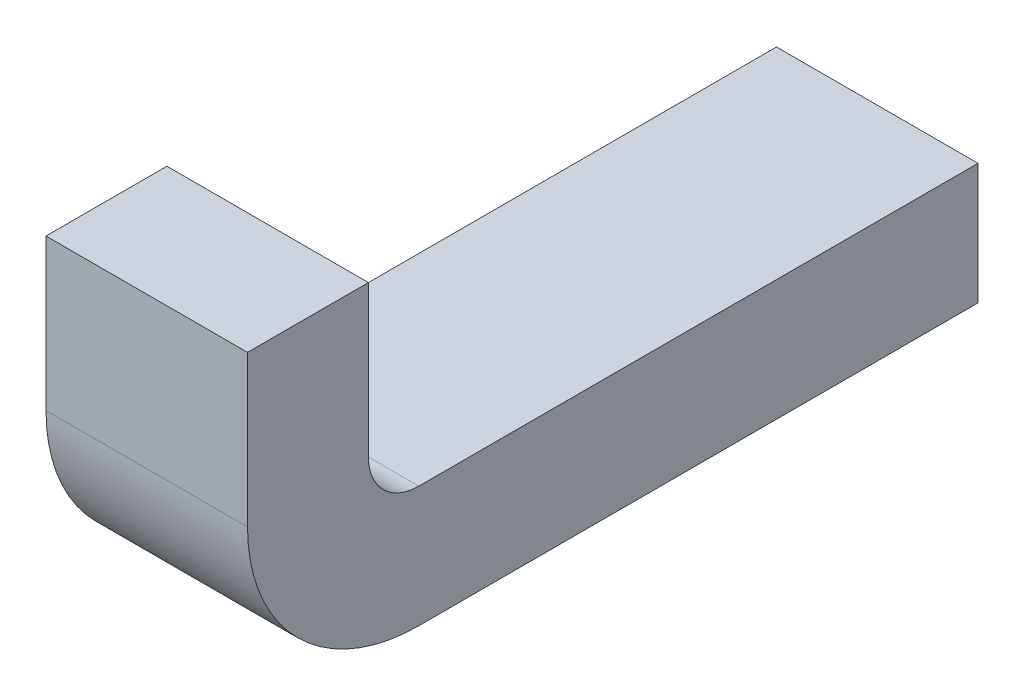
ISO-10303-21;
HEADER;
FILE_DESCRIPTION(('STEP AP214'),'2;1');
FILE_NAME('part.step','',(''),(''),'','','');
FILE_SCHEMA(('AUTOMOTIVE_DESIGN { 1 0 10303 214 1 1 1 1 }'));
ENDSEC;
DATA;
#1=APPLICATION_CONTEXT('core data for automotive mechanical design processes');
#2=APPLICATION_PROTOCOL_DEFINITION('international standard','automotive_design',2000,#1);
#3=PRODUCT_CONTEXT('',#1,'mechanical');
#4=PRODUCT('Part','Part','',(#3));
#5=PRODUCT_RELATED_PRODUCT_CATEGORY('part','',(#4));
#6=PRODUCT_DEFINITION_FORMATION('','',#4);
#7=PRODUCT_DEFINITION_CONTEXT('part definition',#1,'design');
#8=PRODUCT_DEFINITION('design','',#6,#7);
#9=PRODUCT_DEFINITION_SHAPE('','',#8);
#10=(LENGTH_UNIT() NAMED_UNIT(*) SI_UNIT(.MILLI.,.METRE.));
#11=(NAMED_UNIT(*) PLANE_ANGLE_UNIT() SI_UNIT($,.RADIAN.));
#12=(NAMED_UNIT(*) SI_UNIT($,.STERADIAN.) SOLID_ANGLE_UNIT());
#13=UNCERTAINTY_MEASURE_WITH_UNIT(LENGTH_MEASURE(1.E-05),#10,'distance_accuracy_value','');
#14=(GEOMETRIC_REPRESENTATION_CONTEXT(3) GLOBAL_UNCERTAINTY_ASSIGNED_CONTEXT((#13)) GLOBAL_UNIT_ASSIGNED_CONTEXT((#10,
#11,#12)) REPRESENTATION_CONTEXT('',''));
#15=CARTESIAN_POINT('',(0.,0.,0.));
#16=DIRECTION('',(0.,0.,1.));
#17=DIRECTION('',(1.,0.,0.));
#18=AXIS2_PLACEMENT_3D('',#15,#16,#17);
#19=CARTESIAN_POINT('',(-0.35,0.,-3.300000000002));
#20=DIRECTION('',(0.,-1.,0.));
#21=DIRECTION('',(1.,0.,0.));
#22=AXIS2_PLACEMENT_3D('',#19,#20,#21);
#23=PLANE('',#22);
#24=DIRECTION('',(0.,0.,1.));
#25=VECTOR('',#24,1.);
#26=CARTESIAN_POINT('',(-0.35,0.,-3.300000000002));
#27=LINE('',#26,#25);
#28=CARTESIAN_POINT('',(-0.35,0.,-3.300000000002));
#29=VERTEX_POINT('',#28);
#30=CARTESIAN_POINT('',(-0.35,0.,-3.854999999999));
#31=VERTEX_POINT('',#30);
#32=EDGE_CURVE('E121',#29,#31,#27,.F.);
#33=ORIENTED_EDGE('',*,*,#32,.T.);
#34=DIRECTION('',(-1.,0.,0.));
#35=VECTOR('',#34,1.);
#36=CARTESIAN_POINT('',(-0.35,0.,-3.854999999999));
#37=LINE('',#36,#35);
#38=CARTESIAN_POINT('',(-0.15,0.,-3.854999999999));
#39=VERTEX_POINT('',#38);
#40=EDGE_CURVE('E124',#39,#31,#37,.T.);
#41=ORIENTED_EDGE('',*,*,#40,.F.);
#42=DIRECTION('',(0.,0.,1.));
#43=VECTOR('',#42,1.);
#44=CARTESIAN_POINT('',(-0.15,0.,-3.300000000002));
#45=LINE('',#44,#43);
#46=CARTESIAN_POINT('',(-0.15,0.,-3.300000000002));
#47=VERTEX_POINT('',#46);
#48=EDGE_CURVE('E154',#47,#39,#45,.F.);
#49=ORIENTED_EDGE('',*,*,#48,.F.);
#50=DIRECTION('',(1.,0.,0.));
#51=VECTOR('',#50,1.);
#52=CARTESIAN_POINT('',(-0.35,0.,-3.300000000002));
#53=LINE('',#52,#51);
#54=EDGE_CURVE('E63',#29,#47,#53,.T.);
#55=ORIENTED_EDGE('',*,*,#54,.F.);
#56=EDGE_LOOP('',(#33,#41,#49,#55));
#57=FACE_BOUND('',#56,.T.);
#58=ADVANCED_FACE('F16',(#57),#23,.T.);
#59=CARTESIAN_POINT('',(-0.35,0.32,-3.250000000002));
#60=DIRECTION('',(0.,1.,1.246832498358E-13));
#61=DIRECTION('',(0.,-1.246832498358E-13,1.));
#62=AXIS2_PLACEMENT_3D('',#59,#60,#61);
#63=PLANE('',#62);
#64=DIRECTION('',(0.,0.,1.));
#65=VECTOR('',#64,1.);
#66=CARTESIAN_POINT('',(-0.35,0.32,-3.300000000002));
#67=LINE('',#66,#65);
#68=CARTESIAN_POINT('',(-0.35,0.32,-3.250000000002));
#69=VERTEX_POINT('',#68);
#70=CARTESIAN_POINT('',(-0.35,0.32,-3.130000000002));
#71=VERTEX_POINT('',#70);
#72=EDGE_CURVE('E100',#69,#71,#67,.T.);
#73=ORIENTED_EDGE('',*,*,#72,.T.);
#74=DIRECTION('',(1.,0.,0.));
#75=VECTOR('',#74,1.);
#76=CARTESIAN_POINT('',(-0.35,0.32,-3.130000000002));
#77=LINE('',#76,#75);
#78=CARTESIAN_POINT('',(-0.15,0.32,-3.130000000002));
#79=VERTEX_POINT('',#78);
#80=EDGE_CURVE('E162',#79,#71,#77,.F.);
#81=ORIENTED_EDGE('',*,*,#80,.F.);
#82=DIRECTION('',(0.,0.,1.));
#83=VECTOR('',#82,1.);
#84=CARTESIAN_POINT('',(-0.15,0.32,-3.300000000002));
#85=LINE('',#84,#83);
#86=CARTESIAN_POINT('',(-0.15,0.32,-3.250000000002));
#87=VERTEX_POINT('',#86);
#88=EDGE_CURVE('E150',#87,#79,#85,.T.);
#89=ORIENTED_EDGE('',*,*,#88,.F.);
#90=DIRECTION('',(-1.,0.,0.));
#91=VECTOR('',#90,1.);
#92=CARTESIAN_POINT('',(-0.35,0.32,-3.250000000002));
#93=LINE('',#92,#91);
#94=EDGE_CURVE('E72',#69,#87,#93,.F.);
#95=ORIENTED_EDGE('',*,*,#94,.F.);
#96=EDGE_LOOP('',(#73,#81,#89,#95));
#97=FACE_BOUND('',#96,.T.);
#98=ADVANCED_FACE('F182',(#97),#63,.T.);
#99=CARTESIAN_POINT('',(-0.35,0.32,-3.130000000002));
#100=DIRECTION('',(0.,0.,1.));
#101=DIRECTION('',(1.,0.,0.));
#102=AXIS2_PLACEMENT_3D('',#99,#100,#101);
#103=PLANE('',#102);
#104=DIRECTION('',(0.,1.,0.));
#105=VECTOR('',#104,1.);
#106=CARTESIAN_POINT('',(-0.35,0.17,-3.130000000002));
#107=LINE('',#106,#105);
#108=CARTESIAN_POINT('',(-0.35,0.17,-3.130000000002));
#109=VERTEX_POINT('',#108);
#110=EDGE_CURVE('E110',#71,#109,#107,.F.);
#111=ORIENTED_EDGE('',*,*,#110,.T.);
#112=DIRECTION('',(1.,0.,0.));
#113=VECTOR('',#112,1.);
#114=CARTESIAN_POINT('',(-0.35,0.17,-3.130000000002));
#115=LINE('',#114,#113);
#116=CARTESIAN_POINT('',(-0.15,0.17,-3.130000000002));
#117=VERTEX_POINT('',#116);
#118=EDGE_CURVE('E57',#117,#109,#115,.F.);
#119=ORIENTED_EDGE('',*,*,#118,.F.);
#120=DIRECTION('',(0.,1.,0.));
#121=VECTOR('',#120,1.);
#122=CARTESIAN_POINT('',(-0.15,0.17,-3.130000000002));
#123=LINE('',#122,#121);
#124=EDGE_CURVE('E141',#79,#117,#123,.F.);
#125=ORIENTED_EDGE('',*,*,#124,.F.);
#126=ORIENTED_EDGE('',*,*,#80,.T.);
#127=EDGE_LOOP('',(#111,#119,#125,#126));
#128=FACE_BOUND('',#127,.T.);
#129=ADVANCED_FACE('F183',(#128),#103,.T.);
#130=CARTESIAN_POINT('',(-0.35,0.17,-3.300000000002));
#131=DIRECTION('',(1.,0.,0.));
#132=DIRECTION('',(0.,1.,0.));
#133=AXIS2_PLACEMENT_3D('',#130,#131,#132);
#134=CYLINDRICAL_SURFACE('',#133,0.17);
#135=CARTESIAN_POINT('',(-0.35,0.17,-3.300000000002));
#136=DIRECTION('',(1.,0.,0.));
#137=DIRECTION('',(0.,1.,0.));
#138=AXIS2_PLACEMENT_3D('',#135,#136,#137);
#139=CIRCLE('',#138,0.17);
#140=EDGE_CURVE('E96',#109,#29,#139,.T.);
#141=ORIENTED_EDGE('',*,*,#140,.T.);
#142=ORIENTED_EDGE('',*,*,#54,.T.);
#143=CARTESIAN_POINT('',(-0.15,0.17,-3.300000000002));
#144=DIRECTION('',(1.,0.,0.));
#145=DIRECTION('',(0.,1.,0.));
#146=AXIS2_PLACEMENT_3D('',#143,#144,#145);
#147=CIRCLE('',#146,0.17);
#148=EDGE_CURVE('E19',#117,#47,#147,.T.);
#149=ORIENTED_EDGE('',*,*,#148,.F.);
#150=ORIENTED_EDGE('',*,*,#118,.T.);
#151=EDGE_LOOP('',(#141,#142,#149,#150));
#152=FACE_BOUND('',#151,.T.);
#153=ADVANCED_FACE('F185',(#152),#134,.T.);
#154=CARTESIAN_POINT('',(-0.35,0.17,-3.250000000002));
#155=DIRECTION('',(0.,0.,-1.));
#156=DIRECTION('',(-1.,0.,0.));
#157=AXIS2_PLACEMENT_3D('',#154,#155,#156);
#158=PLANE('',#157);
#159=DIRECTION('',(0.,1.,0.));
#160=VECTOR('',#159,1.);
#161=CARTESIAN_POINT('',(-0.35,0.17,-3.250000000002));
#162=LINE('',#161,#160);
#163=CARTESIAN_POINT('',(-0.35,0.17,-3.250000000002));
#164=VERTEX_POINT('',#163);
#165=EDGE_CURVE('E92',#164,#69,#162,.T.);
#166=ORIENTED_EDGE('',*,*,#165,.T.);
#167=ORIENTED_EDGE('',*,*,#94,.T.);
#168=DIRECTION('',(0.,1.,0.));
#169=VECTOR('',#168,1.);
#170=CARTESIAN_POINT('',(-0.15,0.17,-3.250000000002));
#171=LINE('',#170,#169);
#172=CARTESIAN_POINT('',(-0.15,0.17,-3.250000000002));
#173=VERTEX_POINT('',#172);
#174=EDGE_CURVE('E87',#173,#87,#171,.T.);
#175=ORIENTED_EDGE('',*,*,#174,.F.);
#176=DIRECTION('',(1.,0.,0.));
#177=VECTOR('',#176,1.);
#178=CARTESIAN_POINT('',(-0.35,0.17,-3.250000000002));
#179=LINE('',#178,#177);
#180=EDGE_CURVE('E90',#173,#164,#179,.F.);
#181=ORIENTED_EDGE('',*,*,#180,.T.);
#182=EDGE_LOOP('',(#166,#167,#175,#181));
#183=FACE_BOUND('',#182,.T.);
#184=ADVANCED_FACE('F91',(#183),#158,.T.);
#185=CARTESIAN_POINT('',(-0.15,0.17,-3.300000000002));
#186=DIRECTION('',(1.,0.,0.));
#187=DIRECTION('',(0.,1.,0.));
#188=AXIS2_PLACEMENT_3D('',#185,#186,#187);
#189=PLANE('',#188);
#190=ORIENTED_EDGE('',*,*,#88,.T.);
#191=ORIENTED_EDGE('',*,*,#124,.T.);
#192=ORIENTED_EDGE('',*,*,#148,.T.);
#193=ORIENTED_EDGE('',*,*,#48,.T.);
#194=DIRECTION('',(0.,1.,0.));
#195=VECTOR('',#194,1.);
#196=CARTESIAN_POINT('',(-0.15,0.,-3.854999999999));
#197=LINE('',#196,#195);
#198=CARTESIAN_POINT('',(-0.15,0.12,-3.854999999999));
#199=VERTEX_POINT('',#198);
#200=EDGE_CURVE('E138',#199,#39,#197,.F.);
#201=ORIENTED_EDGE('',*,*,#200,.F.);
#202=DIRECTION('',(0.,0.,1.));
#203=VECTOR('',#202,1.);
#204=CARTESIAN_POINT('',(-0.15,0.12,-3.854999999999));
#205=LINE('',#204,#203);
#206=CARTESIAN_POINT('',(-0.15,0.119999999999999,-3.300000000002));
#207=VERTEX_POINT('',#206);
#208=EDGE_CURVE('E107',#207,#199,#205,.F.);
#209=ORIENTED_EDGE('',*,*,#208,.F.);
#210=CARTESIAN_POINT('',(-0.15,0.17,-3.300000000002));
#211=DIRECTION('',(1.,0.,0.));
#212=DIRECTION('',(0.,1.,0.));
#213=AXIS2_PLACEMENT_3D('',#210,#211,#212);
#214=CIRCLE('',#213,0.05);
#215=EDGE_CURVE('E105',#207,#173,#214,.F.);
#216=ORIENTED_EDGE('',*,*,#215,.T.);
#217=ORIENTED_EDGE('',*,*,#174,.T.);
#218=EDGE_LOOP('',(#190,#191,#192,#193,#201,#209,#216,#217));
#219=FACE_BOUND('',#218,.T.);
#220=ADVANCED_FACE('F179',(#219),#189,.T.);
#221=CARTESIAN_POINT('',(-0.35,0.,-3.854999999999));
#222=DIRECTION('',(0.,0.,-1.));
#223=DIRECTION('',(-1.,0.,0.));
#224=AXIS2_PLACEMENT_3D('',#221,#222,#223);
#225=PLANE('',#224);
#226=DIRECTION('',(0.,1.,0.));
#227=VECTOR('',#226,1.);
#228=CARTESIAN_POINT('',(-0.35,0.17,-3.854999999999));
#229=LINE('',#228,#227);
#230=CARTESIAN_POINT('',(-0.35,0.12,-3.854999999999));
#231=VERTEX_POINT('',#230);
#232=EDGE_CURVE('E101',#31,#231,#229,.T.);
#233=ORIENTED_EDGE('',*,*,#232,.T.);
#234=DIRECTION('',(-1.,0.,0.));
#235=VECTOR('',#234,1.);
#236=CARTESIAN_POINT('',(-0.35,0.12,-3.854999999999));
#237=LINE('',#236,#235);
#238=EDGE_CURVE('E128',#199,#231,#237,.T.);
#239=ORIENTED_EDGE('',*,*,#238,.F.);
#240=ORIENTED_EDGE('',*,*,#200,.T.);
#241=ORIENTED_EDGE('',*,*,#40,.T.);
#242=EDGE_LOOP('',(#233,#239,#240,#241));
#243=FACE_BOUND('',#242,.T.);
#244=ADVANCED_FACE('F204',(#243),#225,.T.);
#245=CARTESIAN_POINT('',(-0.35,0.17,-3.300000000002));
#246=DIRECTION('',(1.,0.,0.));
#247=DIRECTION('',(0.,1.,0.));
#248=AXIS2_PLACEMENT_3D('',#245,#246,#247);
#249=PLANE('',#248);
#250=ORIENTED_EDGE('',*,*,#110,.F.);
#251=ORIENTED_EDGE('',*,*,#72,.F.);
#252=ORIENTED_EDGE('',*,*,#165,.F.);
#253=CARTESIAN_POINT('',(-0.35,0.17,-3.300000000002));
#254=DIRECTION('',(1.,0.,0.));
#255=DIRECTION('',(0.,1.,0.));
#256=AXIS2_PLACEMENT_3D('',#253,#254,#255);
#257=CIRCLE('',#256,0.05);
#258=CARTESIAN_POINT('',(-0.35,0.12,-3.300000000002));
#259=VERTEX_POINT('',#258);
#260=EDGE_CURVE('E34',#164,#259,#257,.T.);
#261=ORIENTED_EDGE('',*,*,#260,.T.);
#262=DIRECTION('',(0.,0.,1.));
#263=VECTOR('',#262,1.);
#264=CARTESIAN_POINT('',(-0.35,0.12,-3.854999999999));
#265=LINE('',#264,#263);
#266=EDGE_CURVE('E25',#231,#259,#265,.T.);
#267=ORIENTED_EDGE('',*,*,#266,.F.);
#268=ORIENTED_EDGE('',*,*,#232,.F.);
#269=ORIENTED_EDGE('',*,*,#32,.F.);
#270=ORIENTED_EDGE('',*,*,#140,.F.);
#271=EDGE_LOOP('',(#250,#251,#252,#261,#267,#268,#269,#270));
#272=FACE_BOUND('',#271,.T.);
#273=ADVANCED_FACE('F99',(#272),#249,.F.);
#274=CARTESIAN_POINT('',(-0.35,0.17,-3.300000000002));
#275=DIRECTION('',(1.,0.,0.));
#276=DIRECTION('',(0.,1.,0.));
#277=AXIS2_PLACEMENT_3D('',#274,#275,#276);
#278=CYLINDRICAL_SURFACE('',#277,0.05);
#279=DIRECTION('',(-1.,0.,0.));
#280=VECTOR('',#279,1.);
#281=CARTESIAN_POINT('',(-0.35,0.12,-3.300000000002));
#282=LINE('',#281,#280);
#283=EDGE_CURVE('E11',#259,#207,#282,.F.);
#284=ORIENTED_EDGE('',*,*,#283,.F.);
#285=ORIENTED_EDGE('',*,*,#260,.F.);
#286=ORIENTED_EDGE('',*,*,#180,.F.);
#287=ORIENTED_EDGE('',*,*,#215,.F.);
#288=EDGE_LOOP('',(#284,#285,#286,#287));
#289=FACE_BOUND('',#288,.T.);
#290=ADVANCED_FACE('F103',(#289),#278,.F.);
#291=CARTESIAN_POINT('',(-0.35,0.12,-3.854999999999));
#292=DIRECTION('',(0.,1.,0.));
#293=DIRECTION('',(-1.,0.,0.));
#294=AXIS2_PLACEMENT_3D('',#291,#292,#293);
#295=PLANE('',#294);
#296=ORIENTED_EDGE('',*,*,#266,.T.);
#297=ORIENTED_EDGE('',*,*,#283,.T.);
#298=ORIENTED_EDGE('',*,*,#208,.T.);
#299=ORIENTED_EDGE('',*,*,#238,.T.);
#300=EDGE_LOOP('',(#296,#297,#298,#299));
#301=FACE_BOUND('',#300,.T.);
#302=ADVANCED_FACE('F193',(#301),#295,.T.);
#303=CLOSED_SHELL('',(#58,#98,#129,#153,#184,#220,#244,#273,#290,#302));
#304=MANIFOLD_SOLID_BREP('B1',#303);
#305=ADVANCED_BREP_SHAPE_REPRESENTATION('',(#18,#304),#14);
#306=SHAPE_DEFINITION_REPRESENTATION(#9,#305);
ENDSEC;
END-ISO-10303-21;
